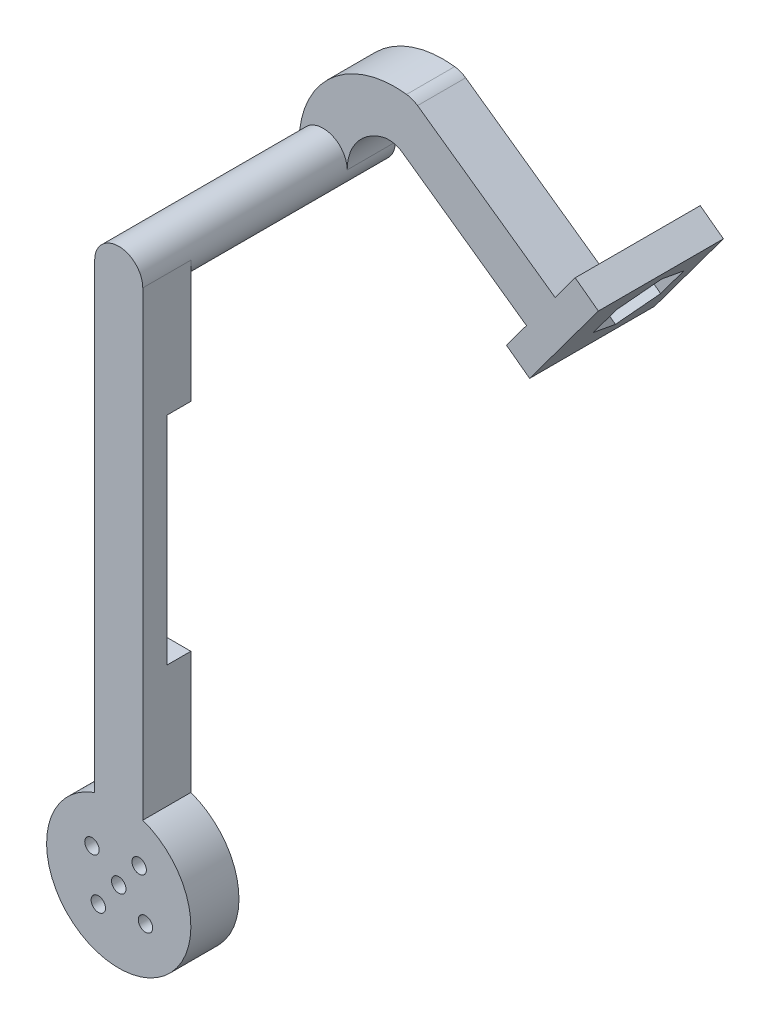
ISO-10303-21;
HEADER;
FILE_DESCRIPTION(('STEP AP214'),'2;1');
FILE_NAME('part.step','',(''),(''),'','','');
FILE_SCHEMA(('AUTOMOTIVE_DESIGN { 1 0 10303 214 1 1 1 1 }'));
ENDSEC;
DATA;
#1=APPLICATION_CONTEXT('core data for automotive mechanical design processes');
#2=APPLICATION_PROTOCOL_DEFINITION('international standard','automotive_design',2000,#1);
#3=PRODUCT_CONTEXT('',#1,'mechanical');
#4=PRODUCT('Part','Part','',(#3));
#5=PRODUCT_RELATED_PRODUCT_CATEGORY('part','',(#4));
#6=PRODUCT_DEFINITION_FORMATION('','',#4);
#7=PRODUCT_DEFINITION_CONTEXT('part definition',#1,'design');
#8=PRODUCT_DEFINITION('design','',#6,#7);
#9=PRODUCT_DEFINITION_SHAPE('','',#8);
#10=(LENGTH_UNIT() NAMED_UNIT(*) SI_UNIT(.MILLI.,.METRE.));
#11=(NAMED_UNIT(*) PLANE_ANGLE_UNIT() SI_UNIT($,.RADIAN.));
#12=(NAMED_UNIT(*) SI_UNIT($,.STERADIAN.) SOLID_ANGLE_UNIT());
#13=UNCERTAINTY_MEASURE_WITH_UNIT(LENGTH_MEASURE(1.E-05),#10,'distance_accuracy_value','');
#14=(GEOMETRIC_REPRESENTATION_CONTEXT(3) GLOBAL_UNCERTAINTY_ASSIGNED_CONTEXT((#13)) GLOBAL_UNIT_ASSIGNED_CONTEXT((#10,
#11,#12)) REPRESENTATION_CONTEXT('',''));
#15=CARTESIAN_POINT('',(0.,0.,0.));
#16=DIRECTION('',(0.,0.,1.));
#17=DIRECTION('',(1.,0.,0.));
#18=AXIS2_PLACEMENT_3D('',#15,#16,#17);
#19=CARTESIAN_POINT('',(-5.,70.,42.5));
#20=DIRECTION('',(0.,0.,1.));
#21=DIRECTION('',(1.,0.,0.));
#22=AXIS2_PLACEMENT_3D('',#19,#20,#21);
#23=PLANE('',#22);
#24=CARTESIAN_POINT('',(-4.99999999999998,-40.,42.5));
#25=DIRECTION('',(0.,0.,-1.));
#26=DIRECTION('',(-1.,0.,0.));
#27=AXIS2_PLACEMENT_3D('',#24,#25,#26);
#28=CIRCLE('',#27,1.5);
#29=CARTESIAN_POINT('',(-6.49999999999998,-40.,42.5));
#30=VERTEX_POINT('',#29);
#31=EDGE_CURVE('E339',#30,#30,#28,.T.);
#32=ORIENTED_EDGE('',*,*,#31,.F.);
#33=EDGE_LOOP('',(#32));
#34=FACE_BOUND('',#33,.T.);
#35=CARTESIAN_POINT('',(-10.5656613127386,-35.7546008253776,42.5));
#36=DIRECTION('',(0.,0.,-1.));
#37=DIRECTION('',(-1.,0.,0.));
#38=AXIS2_PLACEMENT_3D('',#35,#36,#37);
#39=CIRCLE('',#38,1.5);
#40=CARTESIAN_POINT('',(-12.0656613127386,-35.7546008253776,42.5));
#41=VERTEX_POINT('',#40);
#42=EDGE_CURVE('E340',#41,#41,#39,.T.);
#43=ORIENTED_EDGE('',*,*,#42,.F.);
#44=EDGE_LOOP('',(#43));
#45=FACE_BOUND('',#44,.T.);
#46=CARTESIAN_POINT('',(-0.754600825377485,-34.4343386872617,42.5));
#47=DIRECTION('',(0.,0.,-1.));
#48=DIRECTION('',(-1.,0.,0.));
#49=AXIS2_PLACEMENT_3D('',#46,#47,#48);
#50=CIRCLE('',#49,1.50000000000032);
#51=CARTESIAN_POINT('',(-2.2546008253778,-34.4343386872617,42.5));
#52=VERTEX_POINT('',#51);
#53=EDGE_CURVE('E346',#52,#52,#50,.T.);
#54=ORIENTED_EDGE('',*,*,#53,.F.);
#55=EDGE_LOOP('',(#54));
#56=FACE_BOUND('',#55,.T.);
#57=CARTESIAN_POINT('',(0.565661312738365,-44.2453991746228,42.5));
#58=DIRECTION('',(0.,0.,-1.));
#59=DIRECTION('',(-1.,0.,0.));
#60=AXIS2_PLACEMENT_3D('',#57,#58,#59);
#61=CIRCLE('',#60,1.50000000000042);
#62=CARTESIAN_POINT('',(-0.934338687262058,-44.2453991746228,42.5));
#63=VERTEX_POINT('',#62);
#64=EDGE_CURVE('E352',#63,#63,#61,.T.);
#65=ORIENTED_EDGE('',*,*,#64,.F.);
#66=EDGE_LOOP('',(#65));
#67=FACE_BOUND('',#66,.T.);
#68=CARTESIAN_POINT('',(-9.24539917462271,-45.5656613127386,42.5));
#69=DIRECTION('',(0.,0.,-1.));
#70=DIRECTION('',(-1.,0.,0.));
#71=AXIS2_PLACEMENT_3D('',#68,#69,#70);
#72=CIRCLE('',#71,1.50000000000016);
#73=CARTESIAN_POINT('',(-10.7453991746229,-45.5656613127386,42.5));
#74=VERTEX_POINT('',#73);
#75=EDGE_CURVE('E335',#74,#74,#72,.T.);
#76=ORIENTED_EDGE('',*,*,#75,.F.);
#77=EDGE_LOOP('',(#76));
#78=FACE_BOUND('',#77,.T.);
#79=DIRECTION('',(0.,-1.,0.));
#80=VECTOR('',#79,1.);
#81=CARTESIAN_POINT('',(-10.,70.,42.5));
#82=LINE('',#81,#80);
#83=CARTESIAN_POINT('',(-10.,-0.428932188134513,42.5));
#84=VERTEX_POINT('',#83);
#85=CARTESIAN_POINT('',(-9.99999999999999,-25.8578643762691,42.5));
#86=VERTEX_POINT('',#85);
#87=EDGE_CURVE('E363',#84,#86,#82,.T.);
#88=ORIENTED_EDGE('',*,*,#87,.F.);
#89=DIRECTION('',(-1.,0.,0.));
#90=VECTOR('',#89,1.);
#91=CARTESIAN_POINT('',(0.,-0.428932188134511,42.5));
#92=LINE('',#91,#90);
#93=CARTESIAN_POINT('',(0.,-0.428932188134511,42.5));
#94=VERTEX_POINT('',#93);
#95=EDGE_CURVE('E245',#94,#84,#92,.T.);
#96=ORIENTED_EDGE('',*,*,#95,.F.);
#97=DIRECTION('',(0.,1.,0.));
#98=VECTOR('',#97,1.);
#99=CARTESIAN_POINT('',(0.,70.,42.5));
#100=LINE('',#99,#98);
#101=CARTESIAN_POINT('',(0.,-25.857864376269,42.5));
#102=VERTEX_POINT('',#101);
#103=EDGE_CURVE('E236',#102,#94,#100,.T.);
#104=ORIENTED_EDGE('',*,*,#103,.F.);
#105=CARTESIAN_POINT('',(-4.99999999999999,-40.,42.5));
#106=DIRECTION('',(0.,0.,1.));
#107=DIRECTION('',(1.,0.,0.));
#108=AXIS2_PLACEMENT_3D('',#105,#106,#107);
#109=CIRCLE('',#108,15.);
#110=EDGE_CURVE('E379',#86,#102,#109,.T.);
#111=ORIENTED_EDGE('',*,*,#110,.F.);
#112=EDGE_LOOP('',(#88,#96,#104,#111));
#113=FACE_BOUND('',#112,.T.);
#114=ADVANCED_FACE('F35',(#34,#45,#56,#67,#78,#113),#23,.F.);
#115=CARTESIAN_POINT('',(46.8101040062718,66.1183287171004,10.));
#116=DIRECTION('',(0.577822415053882,0.816162518534942,0.));
#117=DIRECTION('',(-0.816162518534942,0.577822415053882,0.));
#118=AXIS2_PLACEMENT_3D('',#115,#116,#117);
#119=PLANE('',#118);
#120=DIRECTION('',(0.816162518534942,-0.577822415053882,0.));
#121=VECTOR('',#120,1.);
#122=CARTESIAN_POINT('',(46.8101040062718,66.1183287171004,10.));
#123=LINE('',#122,#121);
#124=CARTESIAN_POINT('',(14.6370161563222,88.8960609689677,10.));
#125=VERTEX_POINT('',#124);
#126=CARTESIAN_POINT('',(43.2377237554058,68.6474835571825,10.));
#127=VERTEX_POINT('',#126);
#128=EDGE_CURVE('E403',#125,#127,#123,.T.);
#129=ORIENTED_EDGE('',*,*,#128,.T.);
#130=DIRECTION('',(0.,0.,-1.));
#131=VECTOR('',#130,1.);
#132=CARTESIAN_POINT('',(43.2377237554058,68.6474835571825,10.));
#133=LINE('',#132,#131);
#134=CARTESIAN_POINT('',(43.2377237554058,68.6474835571825,0.));
#135=VERTEX_POINT('',#134);
#136=EDGE_CURVE('E311',#127,#135,#133,.T.);
#137=ORIENTED_EDGE('',*,*,#136,.T.);
#138=DIRECTION('',(0.816162518534942,-0.577822415053882,0.));
#139=VECTOR('',#138,1.);
#140=CARTESIAN_POINT('',(46.8101040062718,66.1183287171004,0.));
#141=LINE('',#140,#139);
#142=CARTESIAN_POINT('',(14.6370161563222,88.8960609689677,0.));
#143=VERTEX_POINT('',#142);
#144=EDGE_CURVE('E400',#143,#135,#141,.T.);
#145=ORIENTED_EDGE('',*,*,#144,.F.);
#146=DIRECTION('',(0.,0.,-1.));
#147=VECTOR('',#146,1.);
#148=CARTESIAN_POINT('',(14.6370161563222,88.8960609689677,10.));
#149=LINE('',#148,#147);
#150=EDGE_CURVE('E446',#125,#143,#149,.T.);
#151=ORIENTED_EDGE('',*,*,#150,.F.);
#152=EDGE_LOOP('',(#129,#137,#145,#151));
#153=FACE_BOUND('',#152,.T.);
#154=ADVANCED_FACE('F37',(#153),#119,.T.);
#155=CARTESIAN_POINT('',(41.031879855733,57.956703531751,10.));
#156=DIRECTION('',(0.577822415053882,0.816162518534942,0.));
#157=DIRECTION('',(-0.816162518534942,0.577822415053882,0.));
#158=AXIS2_PLACEMENT_3D('',#155,#156,#157);
#159=PLANE('',#158);
#160=DIRECTION('',(0.,0.,-1.));
#161=VECTOR('',#160,1.);
#162=CARTESIAN_POINT('',(37.282165609397,60.6114063542588,10.));
#163=LINE('',#162,#161);
#164=CARTESIAN_POINT('',(37.282165609397,60.6114063542588,10.));
#165=VERTEX_POINT('',#164);
#166=CARTESIAN_POINT('',(37.282165609397,60.6114063542588,0.));
#167=VERTEX_POINT('',#166);
#168=EDGE_CURVE('E309',#165,#167,#163,.T.);
#169=ORIENTED_EDGE('',*,*,#168,.F.);
#170=DIRECTION('',(0.816162518534942,-0.577822415053882,0.));
#171=VECTOR('',#170,1.);
#172=CARTESIAN_POINT('',(41.031879855733,57.956703531751,10.));
#173=LINE('',#172,#171);
#174=CARTESIAN_POINT('',(11.5366284211116,78.8385953480618,10.));
#175=VERTEX_POINT('',#174);
#176=EDGE_CURVE('E417',#175,#165,#173,.T.);
#177=ORIENTED_EDGE('',*,*,#176,.F.);
#178=DIRECTION('',(0.,0.,-1.));
#179=VECTOR('',#178,1.);
#180=CARTESIAN_POINT('',(11.5366284211116,78.8385953480618,10.));
#181=LINE('',#180,#179);
#182=CARTESIAN_POINT('',(11.5366284211116,78.8385953480618,0.));
#183=VERTEX_POINT('',#182);
#184=EDGE_CURVE('E420',#175,#183,#181,.T.);
#185=ORIENTED_EDGE('',*,*,#184,.T.);
#186=DIRECTION('',(0.816162518534942,-0.577822415053882,0.));
#187=VECTOR('',#186,1.);
#188=CARTESIAN_POINT('',(41.031879855733,57.956703531751,0.));
#189=LINE('',#188,#187);
#190=EDGE_CURVE('E407',#183,#167,#189,.T.);
#191=ORIENTED_EDGE('',*,*,#190,.T.);
#192=EDGE_LOOP('',(#169,#177,#185,#191));
#193=FACE_BOUND('',#192,.T.);
#194=ADVANCED_FACE('F516',(#193),#159,.F.);
#195=CARTESIAN_POINT('',(0.,0.,0.));
#196=DIRECTION('',(0.,0.,1.));
#197=DIRECTION('',(1.,0.,0.));
#198=AXIS2_PLACEMENT_3D('',#195,#196,#197);
#199=PLANE('',#198);
#200=DIRECTION('',(0.595415284473228,0.803418097266713,0.));
#201=VECTOR('',#200,1.);
#202=CARTESIAN_POINT('',(47.4079851150517,74.2745870831456,0.));
#203=LINE('',#202,#201);
#204=CARTESIAN_POINT('',(37.3410147158261,60.6908138507508,0.));
#205=VERTEX_POINT('',#204);
#206=EDGE_CURVE('E43',#167,#205,#203,.T.);
#207=ORIENTED_EDGE('',*,*,#206,.F.);
#208=ORIENTED_EDGE('',*,*,#190,.F.);
#209=CARTESIAN_POINT('',(8.64751634584223,74.7577827553871,0.));
#210=DIRECTION('',(0.,0.,1.));
#211=DIRECTION('',(1.,0.,0.));
#212=AXIS2_PLACEMENT_3D('',#209,#210,#211);
#213=CIRCLE('',#212,5.);
#214=CARTESIAN_POINT('',(7.34925608218081,79.5862939428855,0.));
#215=VERTEX_POINT('',#214);
#216=EDGE_CURVE('E432',#183,#215,#213,.T.);
#217=ORIENTED_EDGE('',*,*,#216,.T.);
#218=CARTESIAN_POINT('',(9.92675958554832,70.,0.));
#219=DIRECTION('',(0.,0.,1.));
#220=DIRECTION('',(1.,0.,0.));
#221=AXIS2_PLACEMENT_3D('',#218,#219,#220);
#222=CIRCLE('',#221,9.92675958554832);
#223=CARTESIAN_POINT('',(0.,70.,0.));
#224=VERTEX_POINT('',#223);
#225=EDGE_CURVE('E429',#224,#215,#222,.F.);
#226=ORIENTED_EDGE('',*,*,#225,.F.);
#227=CARTESIAN_POINT('',(-5.,70.,0.));
#228=DIRECTION('',(0.,0.,-1.));
#229=DIRECTION('',(1.,0.,0.));
#230=AXIS2_PLACEMENT_3D('',#227,#228,#229);
#231=CIRCLE('',#230,5.);
#232=CARTESIAN_POINT('',(-10.,70.,0.));
#233=VERTEX_POINT('',#232);
#234=EDGE_CURVE('E393',#224,#233,#231,.T.);
#235=ORIENTED_EDGE('',*,*,#234,.T.);
#236=CARTESIAN_POINT('',(9.92675958554832,70.,0.));
#237=DIRECTION('',(0.,0.,1.));
#238=DIRECTION('',(1.,0.,0.));
#239=AXIS2_PLACEMENT_3D('',#236,#237,#238);
#240=CIRCLE('',#239,19.9267595855483);
#241=CARTESIAN_POINT('',(12.3579308203016,89.7778955909761,0.));
#242=VERTEX_POINT('',#241);
#243=EDGE_CURVE('E426',#233,#242,#240,.F.);
#244=ORIENTED_EDGE('',*,*,#243,.T.);
#245=CARTESIAN_POINT('',(11.7479040810528,84.815248376293,0.));
#246=DIRECTION('',(0.,0.,1.));
#247=DIRECTION('',(1.,0.,0.));
#248=AXIS2_PLACEMENT_3D('',#245,#246,#247);
#249=CIRCLE('',#248,4.99999999999999);
#250=EDGE_CURVE('E423',#143,#242,#249,.T.);
#251=ORIENTED_EDGE('',*,*,#250,.F.);
#252=ORIENTED_EDGE('',*,*,#144,.T.);
#253=CARTESIAN_POINT('',(43.18498868692,68.5763259811395,0.));
#254=VERTEX_POINT('',#253);
#255=EDGE_CURVE('E327',#254,#135,#203,.T.);
#256=ORIENTED_EDGE('',*,*,#255,.F.);
#257=EDGE_CURVE('E326',#205,#254,#203,.T.);
#258=ORIENTED_EDGE('',*,*,#257,.F.);
#259=EDGE_LOOP('',(#207,#208,#217,#226,#235,#244,#251,#252,#256,#258));
#260=FACE_BOUND('',#259,.T.);
#261=ADVANCED_FACE('F467',(#260),#199,.F.);
#262=CARTESIAN_POINT('',(0.,0.,10.));
#263=DIRECTION('',(0.,0.,1.));
#264=DIRECTION('',(1.,0.,0.));
#265=AXIS2_PLACEMENT_3D('',#262,#263,#264);
#266=PLANE('',#265);
#267=ORIENTED_EDGE('',*,*,#176,.T.);
#268=DIRECTION('',(-0.595415284473228,-0.803418097266713,0.));
#269=VECTOR('',#268,1.);
#270=CARTESIAN_POINT('',(-4.92960569182014,3.65334386332791,10.));
#271=LINE('',#270,#269);
#272=CARTESIAN_POINT('',(33.1180182876942,54.9925527487445,10.));
#273=VERTEX_POINT('',#272);
#274=EDGE_CURVE('E300',#165,#273,#271,.T.);
#275=ORIENTED_EDGE('',*,*,#274,.T.);
#276=DIRECTION('',(0.803418097266713,-0.595415284473228,0.));
#277=VECTOR('',#276,1.);
#278=CARTESIAN_POINT('',(38.0476239795144,51.3392088854166,10.));
#279=LINE('',#278,#277);
#280=CARTESIAN_POINT('',(37.9385268712945,51.4200610419051,10.));
#281=VERTEX_POINT('',#280);
#282=EDGE_CURVE('E303',#273,#281,#279,.T.);
#283=ORIENTED_EDGE('',*,*,#282,.T.);
#284=DIRECTION('',(0.595415284473228,0.803418097266712,0.));
#285=VECTOR('',#284,1.);
#286=CARTESIAN_POINT('',(-0.109097108219928,0.0808521564885917,10.));
#287=LINE('',#286,#285);
#288=CARTESIAN_POINT('',(52.2284936986519,70.7020953763062,10.));
#289=VERTEX_POINT('',#288);
#290=EDGE_CURVE('E306',#281,#289,#287,.T.);
#291=ORIENTED_EDGE('',*,*,#290,.T.);
#292=DIRECTION('',(-0.803418097266713,0.595415284473228,0.));
#293=VECTOR('',#292,1.);
#294=CARTESIAN_POINT('',(52.3375908068718,70.6212432198177,10.));
#295=LINE('',#294,#293);
#296=CARTESIAN_POINT('',(47.4079851150517,74.2745870831456,10.));
#297=VERTEX_POINT('',#296);
#298=EDGE_CURVE('E295',#289,#297,#295,.T.);
#299=ORIENTED_EDGE('',*,*,#298,.T.);
#300=DIRECTION('',(-0.595415284473228,-0.803418097266713,0.));
#301=VECTOR('',#300,1.);
#302=CARTESIAN_POINT('',(-4.92960569182014,3.65334386332791,10.));
#303=LINE('',#302,#301);
#304=EDGE_CURVE('E298',#297,#127,#303,.T.);
#305=ORIENTED_EDGE('',*,*,#304,.T.);
#306=ORIENTED_EDGE('',*,*,#128,.F.);
#307=CARTESIAN_POINT('',(11.7479040810528,84.815248376293,10.));
#308=DIRECTION('',(0.,0.,1.));
#309=DIRECTION('',(1.,0.,0.));
#310=AXIS2_PLACEMENT_3D('',#307,#308,#309);
#311=CIRCLE('',#310,4.99999999999999);
#312=CARTESIAN_POINT('',(12.3579308203016,89.7778955909761,10.));
#313=VERTEX_POINT('',#312);
#314=EDGE_CURVE('E406',#125,#313,#311,.T.);
#315=ORIENTED_EDGE('',*,*,#314,.T.);
#316=CARTESIAN_POINT('',(9.92675958554832,70.,10.));
#317=DIRECTION('',(0.,0.,1.));
#318=DIRECTION('',(1.,0.,0.));
#319=AXIS2_PLACEMENT_3D('',#316,#317,#318);
#320=CIRCLE('',#319,19.9267595855483);
#321=CARTESIAN_POINT('',(-10.,70.,10.));
#322=VERTEX_POINT('',#321);
#323=EDGE_CURVE('E409',#322,#313,#320,.F.);
#324=ORIENTED_EDGE('',*,*,#323,.F.);
#325=CARTESIAN_POINT('',(-5.,70.,10.));
#326=DIRECTION('',(0.,0.,1.));
#327=DIRECTION('',(1.,0.,0.));
#328=AXIS2_PLACEMENT_3D('',#325,#326,#327);
#329=CIRCLE('',#328,5.00000000000001);
#330=CARTESIAN_POINT('',(0.,70.,10.));
#331=VERTEX_POINT('',#330);
#332=EDGE_CURVE('E396',#331,#322,#329,.T.);
#333=ORIENTED_EDGE('',*,*,#332,.F.);
#334=CARTESIAN_POINT('',(9.92675958554832,70.,10.));
#335=DIRECTION('',(0.,0.,1.));
#336=DIRECTION('',(1.,0.,0.));
#337=AXIS2_PLACEMENT_3D('',#334,#335,#336);
#338=CIRCLE('',#337,9.92675958554832);
#339=CARTESIAN_POINT('',(7.34925608218081,79.5862939428855,10.));
#340=VERTEX_POINT('',#339);
#341=EDGE_CURVE('E412',#331,#340,#338,.F.);
#342=ORIENTED_EDGE('',*,*,#341,.T.);
#343=CARTESIAN_POINT('',(8.64751634584223,74.7577827553871,10.));
#344=DIRECTION('',(0.,0.,1.));
#345=DIRECTION('',(1.,0.,0.));
#346=AXIS2_PLACEMENT_3D('',#343,#344,#345);
#347=CIRCLE('',#346,5.);
#348=EDGE_CURVE('E414',#175,#340,#347,.T.);
#349=ORIENTED_EDGE('',*,*,#348,.F.);
#350=EDGE_LOOP('',(#267,#275,#283,#291,#299,#305,#306,#315,#324,#333,#342,#349));
#351=FACE_BOUND('',#350,.T.);
#352=ADVANCED_FACE('F477',(#351),#266,.T.);
#353=CARTESIAN_POINT('',(11.7479040810528,84.815248376293,10.));
#354=DIRECTION('',(0.,0.,-1.));
#355=DIRECTION('',(-1.,0.,0.));
#356=AXIS2_PLACEMENT_3D('',#353,#354,#355);
#357=CYLINDRICAL_SURFACE('',#356,4.99999999999999);
#358=ORIENTED_EDGE('',*,*,#250,.T.);
#359=DIRECTION('',(0.,0.,-1.));
#360=VECTOR('',#359,1.);
#361=CARTESIAN_POINT('',(12.3579308203016,89.7778955909761,10.));
#362=LINE('',#361,#360);
#363=EDGE_CURVE('E445',#313,#242,#362,.T.);
#364=ORIENTED_EDGE('',*,*,#363,.F.);
#365=ORIENTED_EDGE('',*,*,#314,.F.);
#366=ORIENTED_EDGE('',*,*,#150,.T.);
#367=EDGE_LOOP('',(#358,#364,#365,#366));
#368=FACE_BOUND('',#367,.T.);
#369=ADVANCED_FACE('F727',(#368),#357,.T.);
#370=CARTESIAN_POINT('',(9.92675958554832,70.,10.));
#371=DIRECTION('',(0.,0.,-1.));
#372=DIRECTION('',(-1.,0.,0.));
#373=AXIS2_PLACEMENT_3D('',#370,#371,#372);
#374=CYLINDRICAL_SURFACE('',#373,19.9267595855483);
#375=ORIENTED_EDGE('',*,*,#243,.F.);
#376=DIRECTION('',(0.,0.,-1.));
#377=VECTOR('',#376,1.);
#378=CARTESIAN_POINT('',(-10.,70.,10.));
#379=LINE('',#378,#377);
#380=EDGE_CURVE('E443',#322,#233,#379,.T.);
#381=ORIENTED_EDGE('',*,*,#380,.F.);
#382=ORIENTED_EDGE('',*,*,#323,.T.);
#383=ORIENTED_EDGE('',*,*,#363,.T.);
#384=EDGE_LOOP('',(#375,#381,#382,#383));
#385=FACE_BOUND('',#384,.T.);
#386=ADVANCED_FACE('F828',(#385),#374,.T.);
#387=CARTESIAN_POINT('',(9.92675958554832,70.,10.));
#388=DIRECTION('',(0.,0.,-1.));
#389=DIRECTION('',(-1.,0.,0.));
#390=AXIS2_PLACEMENT_3D('',#387,#388,#389);
#391=CYLINDRICAL_SURFACE('',#390,9.92675958554832);
#392=ORIENTED_EDGE('',*,*,#225,.T.);
#393=DIRECTION('',(0.,0.,-1.));
#394=VECTOR('',#393,1.);
#395=CARTESIAN_POINT('',(7.34925608218081,79.5862939428855,10.));
#396=LINE('',#395,#394);
#397=EDGE_CURVE('E438',#340,#215,#396,.T.);
#398=ORIENTED_EDGE('',*,*,#397,.F.);
#399=ORIENTED_EDGE('',*,*,#341,.F.);
#400=DIRECTION('',(0.,0.,-1.));
#401=VECTOR('',#400,1.);
#402=CARTESIAN_POINT('',(0.,70.,10.));
#403=LINE('',#402,#401);
#404=EDGE_CURVE('E440',#331,#224,#403,.T.);
#405=ORIENTED_EDGE('',*,*,#404,.T.);
#406=EDGE_LOOP('',(#392,#398,#399,#405));
#407=FACE_BOUND('',#406,.T.);
#408=ADVANCED_FACE('F823',(#407),#391,.F.);
#409=CARTESIAN_POINT('',(8.64751634584223,74.7577827553871,10.));
#410=DIRECTION('',(0.,0.,-1.));
#411=DIRECTION('',(-1.,0.,0.));
#412=AXIS2_PLACEMENT_3D('',#409,#410,#411);
#413=CYLINDRICAL_SURFACE('',#412,5.);
#414=ORIENTED_EDGE('',*,*,#216,.F.);
#415=ORIENTED_EDGE('',*,*,#184,.F.);
#416=ORIENTED_EDGE('',*,*,#348,.T.);
#417=ORIENTED_EDGE('',*,*,#397,.T.);
#418=EDGE_LOOP('',(#414,#415,#416,#417));
#419=FACE_BOUND('',#418,.T.);
#420=ADVANCED_FACE('F532',(#419),#413,.F.);
#421=CARTESIAN_POINT('',(-5.,70.,42.5));
#422=DIRECTION('',(0.,0.,-1.));
#423=DIRECTION('',(-1.,0.,0.));
#424=AXIS2_PLACEMENT_3D('',#421,#422,#423);
#425=CYLINDRICAL_SURFACE('',#424,5.00000000000001);
#426=CARTESIAN_POINT('',(-5.,70.,42.5));
#427=DIRECTION('',(0.,0.,1.));
#428=DIRECTION('',(1.,0.,0.));
#429=AXIS2_PLACEMENT_3D('',#426,#427,#428);
#430=CIRCLE('',#429,5.00000000000001);
#431=CARTESIAN_POINT('',(-10.,70.,42.5));
#432=VERTEX_POINT('',#431);
#433=CARTESIAN_POINT('',(0.,70.,42.5));
#434=VERTEX_POINT('',#433);
#435=EDGE_CURVE('E397',#432,#434,#430,.T.);
#436=ORIENTED_EDGE('',*,*,#435,.F.);
#437=DIRECTION('',(0.,0.,-1.));
#438=VECTOR('',#437,1.);
#439=CARTESIAN_POINT('',(-10.,70.,52.5));
#440=LINE('',#439,#438);
#441=CARTESIAN_POINT('',(-10.,70.,52.5));
#442=VERTEX_POINT('',#441);
#443=EDGE_CURVE('E390',#442,#432,#440,.T.);
#444=ORIENTED_EDGE('',*,*,#443,.F.);
#445=CARTESIAN_POINT('',(-5.,70.,52.5));
#446=DIRECTION('',(0.,0.,1.));
#447=DIRECTION('',(1.,0.,0.));
#448=AXIS2_PLACEMENT_3D('',#445,#446,#447);
#449=CIRCLE('',#448,5.00000000000001);
#450=CARTESIAN_POINT('',(0.,70.,52.5));
#451=VERTEX_POINT('',#450);
#452=EDGE_CURVE('E366',#451,#442,#449,.T.);
#453=ORIENTED_EDGE('',*,*,#452,.F.);
#454=DIRECTION('',(0.,0.,-1.));
#455=VECTOR('',#454,1.);
#456=CARTESIAN_POINT('',(0.,70.,52.5));
#457=LINE('',#456,#455);
#458=EDGE_CURVE('E375',#451,#434,#457,.T.);
#459=ORIENTED_EDGE('',*,*,#458,.T.);
#460=EDGE_LOOP('',(#436,#444,#453,#459));
#461=FACE_BOUND('',#460,.T.);
#462=ORIENTED_EDGE('',*,*,#332,.T.);
#463=ORIENTED_EDGE('',*,*,#380,.T.);
#464=ORIENTED_EDGE('',*,*,#234,.F.);
#465=ORIENTED_EDGE('',*,*,#404,.F.);
#466=EDGE_LOOP('',(#462,#463,#464,#465));
#467=FACE_BOUND('',#466,.T.);
#468=ADVANCED_FACE('F523',(#461,#467),#425,.T.);
#469=CARTESIAN_POINT('',(0.,44.5710678118655,42.5));
#470=VERTEX_POINT('',#469);
#471=EDGE_CURVE('E381',#470,#434,#100,.T.);
#472=ORIENTED_EDGE('',*,*,#471,.F.);
#473=DIRECTION('',(-1.,0.,0.));
#474=VECTOR('',#473,1.);
#475=CARTESIAN_POINT('',(0.,44.5710678118655,42.5));
#476=LINE('',#475,#474);
#477=CARTESIAN_POINT('',(-10.,44.5710678118655,42.5));
#478=VERTEX_POINT('',#477);
#479=EDGE_CURVE('E247',#470,#478,#476,.T.);
#480=ORIENTED_EDGE('',*,*,#479,.T.);
#481=EDGE_CURVE('E376',#432,#478,#82,.T.);
#482=ORIENTED_EDGE('',*,*,#481,.F.);
#483=ORIENTED_EDGE('',*,*,#435,.T.);
#484=EDGE_LOOP('',(#472,#480,#482,#483));
#485=FACE_BOUND('',#484,.T.);
#486=ADVANCED_FACE('F512',(#485),#23,.F.);
#487=CARTESIAN_POINT('',(-10.,70.,52.5));
#488=DIRECTION('',(1.,0.,0.));
#489=DIRECTION('',(0.,1.,0.));
#490=AXIS2_PLACEMENT_3D('',#487,#488,#489);
#491=PLANE('',#490);
#492=DIRECTION('',(0.,1.,0.));
#493=VECTOR('',#492,1.);
#494=CARTESIAN_POINT('',(-10.,44.5710678118655,47.5));
#495=LINE('',#494,#493);
#496=CARTESIAN_POINT('',(-10.,-0.428932188134523,47.5));
#497=VERTEX_POINT('',#496);
#498=CARTESIAN_POINT('',(-10.,44.5710678118655,47.5));
#499=VERTEX_POINT('',#498);
#500=EDGE_CURVE('E239',#497,#499,#495,.T.);
#501=ORIENTED_EDGE('',*,*,#500,.F.);
#502=DIRECTION('',(0.,0.,1.));
#503=VECTOR('',#502,1.);
#504=CARTESIAN_POINT('',(-10.,-0.428932188134513,42.5));
#505=LINE('',#504,#503);
#506=EDGE_CURVE('E221',#84,#497,#505,.T.);
#507=ORIENTED_EDGE('',*,*,#506,.F.);
#508=ORIENTED_EDGE('',*,*,#87,.T.);
#509=DIRECTION('',(0.,0.,-1.));
#510=VECTOR('',#509,1.);
#511=CARTESIAN_POINT('',(-9.99999999999999,-25.8578643762691,52.5));
#512=LINE('',#511,#510);
#513=CARTESIAN_POINT('',(-9.99999999999999,-25.8578643762691,52.5));
#514=VERTEX_POINT('',#513);
#515=EDGE_CURVE('E387',#514,#86,#512,.T.);
#516=ORIENTED_EDGE('',*,*,#515,.F.);
#517=DIRECTION('',(0.,-1.,0.));
#518=VECTOR('',#517,1.);
#519=CARTESIAN_POINT('',(-10.,70.,52.5));
#520=LINE('',#519,#518);
#521=EDGE_CURVE('E369',#442,#514,#520,.T.);
#522=ORIENTED_EDGE('',*,*,#521,.F.);
#523=ORIENTED_EDGE('',*,*,#443,.T.);
#524=ORIENTED_EDGE('',*,*,#481,.T.);
#525=DIRECTION('',(0.,0.,-1.));
#526=VECTOR('',#525,1.);
#527=CARTESIAN_POINT('',(-10.,44.5710678118655,47.5));
#528=LINE('',#527,#526);
#529=EDGE_CURVE('E237',#499,#478,#528,.T.);
#530=ORIENTED_EDGE('',*,*,#529,.F.);
#531=EDGE_LOOP('',(#501,#507,#508,#516,#522,#523,#524,#530));
#532=FACE_BOUND('',#531,.T.);
#533=ADVANCED_FACE('F522',(#532),#491,.F.);
#534=CARTESIAN_POINT('',(-4.99999999999999,-40.,52.5));
#535=DIRECTION('',(0.,0.,-1.));
#536=DIRECTION('',(-1.,0.,0.));
#537=AXIS2_PLACEMENT_3D('',#534,#535,#536);
#538=CYLINDRICAL_SURFACE('',#537,15.);
#539=ORIENTED_EDGE('',*,*,#110,.T.);
#540=DIRECTION('',(0.,0.,-1.));
#541=VECTOR('',#540,1.);
#542=CARTESIAN_POINT('',(0.,-25.857864376269,52.5));
#543=LINE('',#542,#541);
#544=CARTESIAN_POINT('',(0.,-25.857864376269,52.5));
#545=VERTEX_POINT('',#544);
#546=EDGE_CURVE('E385',#545,#102,#543,.T.);
#547=ORIENTED_EDGE('',*,*,#546,.F.);
#548=CARTESIAN_POINT('',(-4.99999999999999,-40.,52.5));
#549=DIRECTION('',(0.,0.,1.));
#550=DIRECTION('',(1.,0.,0.));
#551=AXIS2_PLACEMENT_3D('',#548,#549,#550);
#552=CIRCLE('',#551,15.);
#553=EDGE_CURVE('E371',#514,#545,#552,.T.);
#554=ORIENTED_EDGE('',*,*,#553,.F.);
#555=ORIENTED_EDGE('',*,*,#515,.T.);
#556=EDGE_LOOP('',(#539,#547,#554,#555));
#557=FACE_BOUND('',#556,.T.);
#558=ADVANCED_FACE('F529',(#557),#538,.T.);
#559=CARTESIAN_POINT('',(0.,70.,52.5));
#560=DIRECTION('',(-1.,0.,0.));
#561=DIRECTION('',(0.,-1.,0.));
#562=AXIS2_PLACEMENT_3D('',#559,#560,#561);
#563=PLANE('',#562);
#564=ORIENTED_EDGE('',*,*,#103,.T.);
#565=DIRECTION('',(0.,0.,1.));
#566=VECTOR('',#565,1.);
#567=CARTESIAN_POINT('',(0.,-0.428932188134511,42.5));
#568=LINE('',#567,#566);
#569=CARTESIAN_POINT('',(0.,-0.428932188134522,47.5));
#570=VERTEX_POINT('',#569);
#571=EDGE_CURVE('E218',#94,#570,#568,.T.);
#572=ORIENTED_EDGE('',*,*,#571,.T.);
#573=DIRECTION('',(0.,1.,0.));
#574=VECTOR('',#573,1.);
#575=CARTESIAN_POINT('',(0.,44.5710678118655,47.5));
#576=LINE('',#575,#574);
#577=CARTESIAN_POINT('',(0.,44.5710678118655,47.5));
#578=VERTEX_POINT('',#577);
#579=EDGE_CURVE('E228',#570,#578,#576,.T.);
#580=ORIENTED_EDGE('',*,*,#579,.T.);
#581=DIRECTION('',(0.,0.,-1.));
#582=VECTOR('',#581,1.);
#583=CARTESIAN_POINT('',(0.,44.5710678118655,47.5));
#584=LINE('',#583,#582);
#585=EDGE_CURVE('E50',#578,#470,#584,.T.);
#586=ORIENTED_EDGE('',*,*,#585,.T.);
#587=ORIENTED_EDGE('',*,*,#471,.T.);
#588=ORIENTED_EDGE('',*,*,#458,.F.);
#589=DIRECTION('',(0.,1.,0.));
#590=VECTOR('',#589,1.);
#591=CARTESIAN_POINT('',(0.,70.,52.5));
#592=LINE('',#591,#590);
#593=EDGE_CURVE('E373',#545,#451,#592,.T.);
#594=ORIENTED_EDGE('',*,*,#593,.F.);
#595=ORIENTED_EDGE('',*,*,#546,.T.);
#596=EDGE_LOOP('',(#564,#572,#580,#586,#587,#588,#594,#595));
#597=FACE_BOUND('',#596,.T.);
#598=ADVANCED_FACE('F233',(#597),#563,.F.);
#599=CARTESIAN_POINT('',(-5.,70.,52.5));
#600=DIRECTION('',(0.,0.,1.));
#601=DIRECTION('',(1.,0.,0.));
#602=AXIS2_PLACEMENT_3D('',#599,#600,#601);
#603=PLANE('',#602);
#604=CARTESIAN_POINT('',(-9.24539917462271,-45.5656613127386,52.5));
#605=DIRECTION('',(0.,0.,-1.));
#606=DIRECTION('',(-1.,0.,0.));
#607=AXIS2_PLACEMENT_3D('',#604,#605,#606);
#608=CIRCLE('',#607,1.50000000000016);
#609=CARTESIAN_POINT('',(-10.7453991746229,-45.5656613127386,52.5));
#610=VERTEX_POINT('',#609);
#611=EDGE_CURVE('E355',#610,#610,#608,.T.);
#612=ORIENTED_EDGE('',*,*,#611,.T.);
#613=EDGE_LOOP('',(#612));
#614=FACE_BOUND('',#613,.T.);
#615=CARTESIAN_POINT('',(0.565661312738365,-44.2453991746228,52.5));
#616=DIRECTION('',(0.,0.,-1.));
#617=DIRECTION('',(-1.,0.,0.));
#618=AXIS2_PLACEMENT_3D('',#615,#616,#617);
#619=CIRCLE('',#618,1.50000000000042);
#620=CARTESIAN_POINT('',(-0.934338687262058,-44.2453991746228,52.5));
#621=VERTEX_POINT('',#620);
#622=EDGE_CURVE('E349',#621,#621,#619,.T.);
#623=ORIENTED_EDGE('',*,*,#622,.T.);
#624=EDGE_LOOP('',(#623));
#625=FACE_BOUND('',#624,.T.);
#626=CARTESIAN_POINT('',(-0.754600825377485,-34.4343386872617,52.5));
#627=DIRECTION('',(0.,0.,-1.));
#628=DIRECTION('',(-1.,0.,0.));
#629=AXIS2_PLACEMENT_3D('',#626,#627,#628);
#630=CIRCLE('',#629,1.50000000000032);
#631=CARTESIAN_POINT('',(-2.2546008253778,-34.4343386872617,52.5));
#632=VERTEX_POINT('',#631);
#633=EDGE_CURVE('E343',#632,#632,#630,.T.);
#634=ORIENTED_EDGE('',*,*,#633,.T.);
#635=EDGE_LOOP('',(#634));
#636=FACE_BOUND('',#635,.T.);
#637=CARTESIAN_POINT('',(-10.5656613127386,-35.7546008253776,52.5));
#638=DIRECTION('',(0.,0.,-1.));
#639=DIRECTION('',(-1.,0.,0.));
#640=AXIS2_PLACEMENT_3D('',#637,#638,#639);
#641=CIRCLE('',#640,1.5);
#642=CARTESIAN_POINT('',(-12.0656613127386,-35.7546008253776,52.5));
#643=VERTEX_POINT('',#642);
#644=EDGE_CURVE('E336',#643,#643,#641,.T.);
#645=ORIENTED_EDGE('',*,*,#644,.T.);
#646=EDGE_LOOP('',(#645));
#647=FACE_BOUND('',#646,.T.);
#648=CARTESIAN_POINT('',(-4.99999999999998,-40.,52.5));
#649=DIRECTION('',(0.,0.,-1.));
#650=DIRECTION('',(-1.,0.,0.));
#651=AXIS2_PLACEMENT_3D('',#648,#649,#650);
#652=CIRCLE('',#651,1.5);
#653=CARTESIAN_POINT('',(-6.49999999999998,-40.,52.5));
#654=VERTEX_POINT('',#653);
#655=EDGE_CURVE('E360',#654,#654,#652,.T.);
#656=ORIENTED_EDGE('',*,*,#655,.T.);
#657=EDGE_LOOP('',(#656));
#658=FACE_BOUND('',#657,.T.);
#659=ORIENTED_EDGE('',*,*,#452,.T.);
#660=ORIENTED_EDGE('',*,*,#521,.T.);
#661=ORIENTED_EDGE('',*,*,#553,.T.);
#662=ORIENTED_EDGE('',*,*,#593,.T.);
#663=EDGE_LOOP('',(#659,#660,#661,#662));
#664=FACE_BOUND('',#663,.T.);
#665=ADVANCED_FACE('F543',(#614,#625,#636,#647,#658,#664),#603,.T.);
#666=CARTESIAN_POINT('',(-4.99999999999998,-40.,52.5));
#667=DIRECTION('',(0.,0.,-1.));
#668=DIRECTION('',(-1.,0.,0.));
#669=AXIS2_PLACEMENT_3D('',#666,#667,#668);
#670=CYLINDRICAL_SURFACE('',#669,1.5);
#671=ORIENTED_EDGE('',*,*,#655,.F.);
#672=EDGE_LOOP('',(#671));
#673=FACE_BOUND('',#672,.T.);
#674=ORIENTED_EDGE('',*,*,#31,.T.);
#675=EDGE_LOOP('',(#674));
#676=FACE_BOUND('',#675,.T.);
#677=ADVANCED_FACE('F793',(#673,#676),#670,.F.);
#678=CARTESIAN_POINT('',(-10.5656613127386,-35.7546008253776,52.5));
#679=DIRECTION('',(0.,0.,-1.));
#680=DIRECTION('',(-1.,0.,0.));
#681=AXIS2_PLACEMENT_3D('',#678,#679,#680);
#682=CYLINDRICAL_SURFACE('',#681,1.5);
#683=ORIENTED_EDGE('',*,*,#644,.F.);
#684=EDGE_LOOP('',(#683));
#685=FACE_BOUND('',#684,.T.);
#686=ORIENTED_EDGE('',*,*,#42,.T.);
#687=EDGE_LOOP('',(#686));
#688=FACE_BOUND('',#687,.T.);
#689=ADVANCED_FACE('F784',(#685,#688),#682,.F.);
#690=CARTESIAN_POINT('',(-0.754600825377485,-34.4343386872617,52.5));
#691=DIRECTION('',(0.,0.,-1.));
#692=DIRECTION('',(-1.,0.,0.));
#693=AXIS2_PLACEMENT_3D('',#690,#691,#692);
#694=CYLINDRICAL_SURFACE('',#693,1.50000000000032);
#695=ORIENTED_EDGE('',*,*,#633,.F.);
#696=EDGE_LOOP('',(#695));
#697=FACE_BOUND('',#696,.T.);
#698=ORIENTED_EDGE('',*,*,#53,.T.);
#699=EDGE_LOOP('',(#698));
#700=FACE_BOUND('',#699,.T.);
#701=ADVANCED_FACE('F775',(#697,#700),#694,.F.);
#702=CARTESIAN_POINT('',(0.565661312738365,-44.2453991746228,52.5));
#703=DIRECTION('',(0.,0.,-1.));
#704=DIRECTION('',(-1.,0.,0.));
#705=AXIS2_PLACEMENT_3D('',#702,#703,#704);
#706=CYLINDRICAL_SURFACE('',#705,1.50000000000042);
#707=ORIENTED_EDGE('',*,*,#622,.F.);
#708=EDGE_LOOP('',(#707));
#709=FACE_BOUND('',#708,.T.);
#710=ORIENTED_EDGE('',*,*,#64,.T.);
#711=EDGE_LOOP('',(#710));
#712=FACE_BOUND('',#711,.T.);
#713=ADVANCED_FACE('F504',(#709,#712),#706,.F.);
#714=CARTESIAN_POINT('',(-9.24539917462271,-45.5656613127386,52.5));
#715=DIRECTION('',(0.,0.,-1.));
#716=DIRECTION('',(-1.,0.,0.));
#717=AXIS2_PLACEMENT_3D('',#714,#715,#716);
#718=CYLINDRICAL_SURFACE('',#717,1.50000000000016);
#719=ORIENTED_EDGE('',*,*,#611,.F.);
#720=EDGE_LOOP('',(#719));
#721=FACE_BOUND('',#720,.T.);
#722=ORIENTED_EDGE('',*,*,#75,.T.);
#723=EDGE_LOOP('',(#722));
#724=FACE_BOUND('',#723,.T.);
#725=ADVANCED_FACE('F496',(#721,#724),#718,.F.);
#726=CARTESIAN_POINT('',(52.2284936986519,70.7020953763062,-16.));
#727=DIRECTION('',(-0.803418097266712,0.595415284473228,0.));
#728=DIRECTION('',(-0.595415284473228,-0.803418097266713,0.));
#729=AXIS2_PLACEMENT_3D('',#726,#727,#728);
#730=PLANE('',#729);
#731=DIRECTION('',(0.595415284473229,0.803418097266712,0.));
#732=VECTOR('',#731,1.);
#733=CARTESIAN_POINT('',(42.6771680615817,57.8141026260045,-12.5000000000001));
#734=LINE('',#733,#732);
#735=CARTESIAN_POINT('',(42.6771680615816,57.8141026260045,-12.5000000000001));
#736=VERTEX_POINT('',#735);
#737=CARTESIAN_POINT('',(47.489852508365,64.308053792207,-12.5000000000001));
#738=VERTEX_POINT('',#737);
#739=EDGE_CURVE('E268',#736,#738,#734,.T.);
#740=ORIENTED_EDGE('',*,*,#739,.F.);
#741=DIRECTION('',(0.297707642236617,0.401709048633361,-0.866025403784435));
#742=VECTOR('',#741,1.);
#743=CARTESIAN_POINT('',(40.27082583819,54.5671270429032,-5.50000000000025));
#744=LINE('',#743,#742);
#745=CARTESIAN_POINT('',(40.27082583819,54.5671270429032,-5.50000000000025));
#746=VERTEX_POINT('',#745);
#747=EDGE_CURVE('E58',#746,#736,#744,.T.);
#748=ORIENTED_EDGE('',*,*,#747,.F.);
#749=DIRECTION('',(-0.297707642236609,-0.401709048633348,-0.866025403784444));
#750=VECTOR('',#749,1.);
#751=CARTESIAN_POINT('',(42.6771680615816,57.8141026260045,1.49999999999981));
#752=LINE('',#751,#750);
#753=CARTESIAN_POINT('',(42.6771680615816,57.8141026260045,1.49999999999981));
#754=VERTEX_POINT('',#753);
#755=EDGE_CURVE('E280',#754,#746,#752,.T.);
#756=ORIENTED_EDGE('',*,*,#755,.F.);
#757=DIRECTION('',(-0.595415284473229,-0.803418097266712,0.));
#758=VECTOR('',#757,1.);
#759=CARTESIAN_POINT('',(47.4898525083649,64.308053792207,1.49999999999988));
#760=LINE('',#759,#758);
#761=CARTESIAN_POINT('',(47.4898525083649,64.308053792207,1.49999999999988));
#762=VERTEX_POINT('',#761);
#763=EDGE_CURVE('E277',#762,#754,#760,.T.);
#764=ORIENTED_EDGE('',*,*,#763,.F.);
#765=DIRECTION('',(-0.297707642236617,-0.401709048633361,0.866025403784436));
#766=VECTOR('',#765,1.);
#767=CARTESIAN_POINT('',(49.8961947317566,67.5550293753083,-5.50000000000011));
#768=LINE('',#767,#766);
#769=CARTESIAN_POINT('',(49.8961947317566,67.5550293753083,-5.50000000000011));
#770=VERTEX_POINT('',#769);
#771=EDGE_CURVE('E274',#770,#762,#768,.T.);
#772=ORIENTED_EDGE('',*,*,#771,.F.);
#773=DIRECTION('',(0.297707642236612,0.401709048633354,0.86602540378444));
#774=VECTOR('',#773,1.);
#775=CARTESIAN_POINT('',(47.489852508365,64.308053792207,-12.5000000000001));
#776=LINE('',#775,#774);
#777=EDGE_CURVE('E271',#738,#770,#776,.T.);
#778=ORIENTED_EDGE('',*,*,#777,.F.);
#779=EDGE_LOOP('',(#740,#748,#756,#764,#772,#778));
#780=FACE_BOUND('',#779,.T.);
#781=DIRECTION('',(0.,0.,1.));
#782=VECTOR('',#781,1.);
#783=CARTESIAN_POINT('',(52.2284936986519,70.7020953763062,-16.));
#784=LINE('',#783,#782);
#785=CARTESIAN_POINT('',(52.2284936986519,70.7020953763062,-16.));
#786=VERTEX_POINT('',#785);
#787=EDGE_CURVE('E323',#786,#289,#784,.T.);
#788=ORIENTED_EDGE('',*,*,#787,.T.);
#789=ORIENTED_EDGE('',*,*,#290,.F.);
#790=DIRECTION('',(0.,0.,1.));
#791=VECTOR('',#790,1.);
#792=CARTESIAN_POINT('',(37.9385268712945,51.4200610419051,-16.));
#793=LINE('',#792,#791);
#794=CARTESIAN_POINT('',(37.9385268712945,51.4200610419051,-16.));
#795=VERTEX_POINT('',#794);
#796=EDGE_CURVE('E333',#795,#281,#793,.T.);
#797=ORIENTED_EDGE('',*,*,#796,.F.);
#798=DIRECTION('',(-0.595415284473228,-0.803418097266712,0.));
#799=VECTOR('',#798,1.);
#800=CARTESIAN_POINT('',(52.2284936986519,70.7020953763062,-16.));
#801=LINE('',#800,#799);
#802=EDGE_CURVE('E314',#786,#795,#801,.T.);
#803=ORIENTED_EDGE('',*,*,#802,.F.);
#804=EDGE_LOOP('',(#788,#789,#797,#803));
#805=FACE_BOUND('',#804,.T.);
#806=ADVANCED_FACE('F494',(#780,#805),#730,.F.);
#807=CARTESIAN_POINT('',(37.9385268712945,51.4200610419051,-16.));
#808=DIRECTION('',(0.595415284473228,0.803418097266713,0.));
#809=DIRECTION('',(-0.803418097266713,0.595415284473228,0.));
#810=AXIS2_PLACEMENT_3D('',#807,#808,#809);
#811=PLANE('',#810);
#812=ORIENTED_EDGE('',*,*,#796,.T.);
#813=ORIENTED_EDGE('',*,*,#282,.F.);
#814=DIRECTION('',(0.,0.,1.));
#815=VECTOR('',#814,1.);
#816=CARTESIAN_POINT('',(33.1180182876942,54.9925527487445,-16.));
#817=LINE('',#816,#815);
#818=CARTESIAN_POINT('',(33.1180182876942,54.9925527487445,-16.));
#819=VERTEX_POINT('',#818);
#820=EDGE_CURVE('E331',#819,#273,#817,.T.);
#821=ORIENTED_EDGE('',*,*,#820,.F.);
#822=DIRECTION('',(-0.803418097266713,0.595415284473228,0.));
#823=VECTOR('',#822,1.);
#824=CARTESIAN_POINT('',(37.9385268712945,51.4200610419051,-16.));
#825=LINE('',#824,#823);
#826=EDGE_CURVE('E317',#795,#819,#825,.T.);
#827=ORIENTED_EDGE('',*,*,#826,.F.);
#828=EDGE_LOOP('',(#812,#813,#821,#827));
#829=FACE_BOUND('',#828,.T.);
#830=ADVANCED_FACE('F492',(#829),#811,.F.);
#831=CARTESIAN_POINT('',(47.4079851150517,74.2745870831456,-16.));
#832=DIRECTION('',(0.803418097266713,-0.595415284473228,0.));
#833=DIRECTION('',(0.595415284473228,0.803418097266713,0.));
#834=AXIS2_PLACEMENT_3D('',#831,#832,#833);
#835=PLANE('',#834);
#836=ORIENTED_EDGE('',*,*,#206,.T.);
#837=DIRECTION('',(0.297707642236608,0.401709048633348,0.866025403784444));
#838=VECTOR('',#837,1.);
#839=CARTESIAN_POINT('',(37.8566594779814,61.3865943328438,1.49999999999981));
#840=LINE('',#839,#838);
#841=CARTESIAN_POINT('',(35.4503172545897,58.1396187497426,-5.50000000000025));
#842=VERTEX_POINT('',#841);
#843=EDGE_CURVE('E261',#842,#205,#840,.T.);
#844=ORIENTED_EDGE('',*,*,#843,.F.);
#845=DIRECTION('',(-0.297707642236617,-0.401709048633361,0.866025403784436));
#846=VECTOR('',#845,1.);
#847=CARTESIAN_POINT('',(35.4503172545897,58.1396187497426,-5.50000000000026));
#848=LINE('',#847,#846);
#849=CARTESIAN_POINT('',(37.8566594779814,61.3865943328439,-12.5000000000001));
#850=VERTEX_POINT('',#849);
#851=EDGE_CURVE('E264',#850,#842,#848,.T.);
#852=ORIENTED_EDGE('',*,*,#851,.F.);
#853=DIRECTION('',(-0.595415284473228,-0.803418097266713,0.));
#854=VECTOR('',#853,1.);
#855=CARTESIAN_POINT('',(37.8566594779814,61.3865943328439,-12.5000000000001));
#856=LINE('',#855,#854);
#857=CARTESIAN_POINT('',(42.6693439247647,67.8805454990464,-12.5000000000001));
#858=VERTEX_POINT('',#857);
#859=EDGE_CURVE('E266',#858,#850,#856,.T.);
#860=ORIENTED_EDGE('',*,*,#859,.F.);
#861=DIRECTION('',(-0.297707642236612,-0.401709048633354,-0.86602540378444));
#862=VECTOR('',#861,1.);
#863=CARTESIAN_POINT('',(42.6693439247647,67.8805454990464,-12.5000000000001));
#864=LINE('',#863,#862);
#865=CARTESIAN_POINT('',(45.0756861481563,71.1275210821477,-5.50000000000011));
#866=VERTEX_POINT('',#865);
#867=EDGE_CURVE('E251',#866,#858,#864,.T.);
#868=ORIENTED_EDGE('',*,*,#867,.F.);
#869=DIRECTION('',(-0.297707642236617,-0.401709048633361,0.866025403784435));
#870=VECTOR('',#869,1.);
#871=CARTESIAN_POINT('',(48.3658958911958,75.5671351133861,-15.0711524227066));
#872=LINE('',#871,#870);
#873=EDGE_CURVE('E11',#866,#254,#872,.T.);
#874=ORIENTED_EDGE('',*,*,#873,.T.);
#875=ORIENTED_EDGE('',*,*,#255,.T.);
#876=ORIENTED_EDGE('',*,*,#136,.F.);
#877=ORIENTED_EDGE('',*,*,#304,.F.);
#878=DIRECTION('',(0.,0.,1.));
#879=VECTOR('',#878,1.);
#880=CARTESIAN_POINT('',(47.4079851150517,74.2745870831456,-16.));
#881=LINE('',#880,#879);
#882=CARTESIAN_POINT('',(47.4079851150517,74.2745870831456,-16.));
#883=VERTEX_POINT('',#882);
#884=EDGE_CURVE('E329',#883,#297,#881,.T.);
#885=ORIENTED_EDGE('',*,*,#884,.F.);
#886=DIRECTION('',(0.595415284473228,0.803418097266713,0.));
#887=VECTOR('',#886,1.);
#888=CARTESIAN_POINT('',(47.4079851150517,74.2745870831456,-16.));
#889=LINE('',#888,#887);
#890=EDGE_CURVE('E319',#819,#883,#889,.T.);
#891=ORIENTED_EDGE('',*,*,#890,.F.);
#892=ORIENTED_EDGE('',*,*,#820,.T.);
#893=ORIENTED_EDGE('',*,*,#274,.F.);
#894=ORIENTED_EDGE('',*,*,#168,.T.);
#895=EDGE_LOOP('',(#836,#844,#852,#860,#868,#874,#875,#876,#877,#885,#891,#892,#893,#894));
#896=FACE_BOUND('',#895,.T.);
#897=ADVANCED_FACE('F465',(#896),#835,.F.);
#898=CARTESIAN_POINT('',(52.2284936986519,70.7020953763062,-16.));
#899=DIRECTION('',(-0.595415284473228,-0.803418097266713,0.));
#900=DIRECTION('',(0.803418097266713,-0.595415284473228,0.));
#901=AXIS2_PLACEMENT_3D('',#898,#899,#900);
#902=PLANE('',#901);
#903=ORIENTED_EDGE('',*,*,#884,.T.);
#904=ORIENTED_EDGE('',*,*,#298,.F.);
#905=ORIENTED_EDGE('',*,*,#787,.F.);
#906=DIRECTION('',(0.803418097266713,-0.595415284473228,0.));
#907=VECTOR('',#906,1.);
#908=CARTESIAN_POINT('',(52.2284936986519,70.7020953763062,-16.));
#909=LINE('',#908,#907);
#910=EDGE_CURVE('E321',#883,#786,#909,.T.);
#911=ORIENTED_EDGE('',*,*,#910,.F.);
#912=EDGE_LOOP('',(#903,#904,#905,#911));
#913=FACE_BOUND('',#912,.T.);
#914=ADVANCED_FACE('F481',(#913),#902,.F.);
#915=CARTESIAN_POINT('',(0.,0.,-16.));
#916=DIRECTION('',(0.,0.,-1.));
#917=DIRECTION('',(-1.,0.,0.));
#918=AXIS2_PLACEMENT_3D('',#915,#916,#917);
#919=PLANE('',#918);
#920=ORIENTED_EDGE('',*,*,#802,.T.);
#921=ORIENTED_EDGE('',*,*,#826,.T.);
#922=ORIENTED_EDGE('',*,*,#890,.T.);
#923=ORIENTED_EDGE('',*,*,#910,.T.);
#924=EDGE_LOOP('',(#920,#921,#922,#923));
#925=FACE_BOUND('',#924,.T.);
#926=ADVANCED_FACE('F484',(#925),#919,.T.);
#927=CARTESIAN_POINT('',(47.4079851150517,74.2745870831456,-16.));
#928=DIRECTION('',(0.803418097266713,-0.595415284473228,0.));
#929=DIRECTION('',(0.595415284473228,0.803418097266713,0.));
#930=AXIS2_PLACEMENT_3D('',#927,#928,#929);
#931=PLANE('',#930);
#932=ORIENTED_EDGE('',*,*,#257,.T.);
#933=DIRECTION('',(0.297707642236617,0.401709048633361,-0.866025403784435));
#934=VECTOR('',#933,1.);
#935=CARTESIAN_POINT('',(45.0756861481563,71.1275210821477,-5.50000000000012));
#936=LINE('',#935,#934);
#937=CARTESIAN_POINT('',(42.6693439247646,67.8805454990464,1.49999999999988));
#938=VERTEX_POINT('',#937);
#939=EDGE_CURVE('E254',#938,#254,#936,.T.);
#940=ORIENTED_EDGE('',*,*,#939,.F.);
#941=DIRECTION('',(0.595415284473228,0.803418097266713,0.));
#942=VECTOR('',#941,1.);
#943=CARTESIAN_POINT('',(42.6693439247647,67.8805454990464,1.49999999999988));
#944=LINE('',#943,#942);
#945=CARTESIAN_POINT('',(37.8566594779813,61.3865943328438,1.49999999999981));
#946=VERTEX_POINT('',#945);
#947=EDGE_CURVE('E258',#946,#938,#944,.T.);
#948=ORIENTED_EDGE('',*,*,#947,.F.);
#949=EDGE_CURVE('E260',#205,#946,#840,.T.);
#950=ORIENTED_EDGE('',*,*,#949,.F.);
#951=EDGE_LOOP('',(#932,#940,#948,#950));
#952=FACE_BOUND('',#951,.T.);
#953=ADVANCED_FACE('F456',(#952),#931,.T.);
#954=CARTESIAN_POINT('',(18.2689374426199,70.8727849345597,-5.50000000000025));
#955=DIRECTION('',(-0.515644762155352,-0.695780482093127,-0.500000000000005));
#956=DIRECTION('',(0.803418097266712,-0.595415284473229,0.));
#957=AXIS2_PLACEMENT_3D('',#954,#955,#956);
#958=PLANE('',#957);
#959=ORIENTED_EDGE('',*,*,#851,.T.);
#960=DIRECTION('',(0.803418097266712,-0.595415284473229,0.));
#961=VECTOR('',#960,1.);
#962=CARTESIAN_POINT('',(18.2689374426199,70.8727849345597,-5.50000000000025));
#963=LINE('',#962,#961);
#964=EDGE_CURVE('E255',#842,#746,#963,.T.);
#965=ORIENTED_EDGE('',*,*,#964,.T.);
#966=ORIENTED_EDGE('',*,*,#747,.T.);
#967=DIRECTION('',(0.803418097266712,-0.595415284473229,0.));
#968=VECTOR('',#967,1.);
#969=CARTESIAN_POINT('',(20.6752796660116,74.119760517661,-12.5000000000001));
#970=LINE('',#969,#968);
#971=EDGE_CURVE('E283',#850,#736,#970,.T.);
#972=ORIENTED_EDGE('',*,*,#971,.F.);
#973=EDGE_LOOP('',(#959,#965,#966,#972));
#974=FACE_BOUND('',#973,.T.);
#975=ADVANCED_FACE('F565',(#974),#958,.F.);
#976=CARTESIAN_POINT('',(20.6752796660115,74.1197605176609,1.49999999999981));
#977=DIRECTION('',(-0.515644762155358,-0.695780482093135,0.49999999999999));
#978=DIRECTION('',(0.803418097266712,-0.595415284473229,0.));
#979=AXIS2_PLACEMENT_3D('',#976,#977,#978);
#980=PLANE('',#979);
#981=ORIENTED_EDGE('',*,*,#843,.T.);
#982=ORIENTED_EDGE('',*,*,#949,.T.);
#983=DIRECTION('',(0.803418097266712,-0.595415284473229,0.));
#984=VECTOR('',#983,1.);
#985=CARTESIAN_POINT('',(20.6752796660115,74.1197605176609,1.49999999999981));
#986=LINE('',#985,#984);
#987=EDGE_CURVE('E285',#946,#754,#986,.T.);
#988=ORIENTED_EDGE('',*,*,#987,.T.);
#989=ORIENTED_EDGE('',*,*,#755,.T.);
#990=ORIENTED_EDGE('',*,*,#964,.F.);
#991=EDGE_LOOP('',(#981,#982,#988,#989,#990));
#992=FACE_BOUND('',#991,.T.);
#993=ADVANCED_FACE('F566',(#992),#980,.F.);
#994=CARTESIAN_POINT('',(25.4879641127948,80.6137116838635,1.49999999999988));
#995=DIRECTION('',(0.,0.,1.));
#996=DIRECTION('',(0.,-1.,0.));
#997=AXIS2_PLACEMENT_3D('',#994,#995,#996);
#998=PLANE('',#997);
#999=ORIENTED_EDGE('',*,*,#947,.T.);
#1000=DIRECTION('',(0.803418097266712,-0.595415284473229,0.));
#1001=VECTOR('',#1000,1.);
#1002=CARTESIAN_POINT('',(25.4879641127948,80.6137116838635,1.49999999999988));
#1003=LINE('',#1002,#1001);
#1004=EDGE_CURVE('E287',#938,#762,#1003,.T.);
#1005=ORIENTED_EDGE('',*,*,#1004,.T.);
#1006=ORIENTED_EDGE('',*,*,#763,.T.);
#1007=ORIENTED_EDGE('',*,*,#987,.F.);
#1008=EDGE_LOOP('',(#999,#1005,#1006,#1007));
#1009=FACE_BOUND('',#1008,.T.);
#1010=ADVANCED_FACE('F569',(#1009),#998,.F.);
#1011=CARTESIAN_POINT('',(27.8943063361865,83.8606872669648,-5.50000000000011));
#1012=DIRECTION('',(0.515644762155352,0.695780482093127,0.500000000000005));
#1013=DIRECTION('',(-0.803418097266712,0.595415284473229,0.));
#1014=AXIS2_PLACEMENT_3D('',#1011,#1012,#1013);
#1015=PLANE('',#1014);
#1016=ORIENTED_EDGE('',*,*,#939,.T.);
#1017=ORIENTED_EDGE('',*,*,#873,.F.);
#1018=DIRECTION('',(0.803418097266712,-0.595415284473229,0.));
#1019=VECTOR('',#1018,1.);
#1020=CARTESIAN_POINT('',(27.8943063361865,83.8606872669648,-5.50000000000011));
#1021=LINE('',#1020,#1019);
#1022=EDGE_CURVE('E289',#866,#770,#1021,.T.);
#1023=ORIENTED_EDGE('',*,*,#1022,.T.);
#1024=ORIENTED_EDGE('',*,*,#771,.T.);
#1025=ORIENTED_EDGE('',*,*,#1004,.F.);
#1026=EDGE_LOOP('',(#1016,#1017,#1023,#1024,#1025));
#1027=FACE_BOUND('',#1026,.T.);
#1028=ADVANCED_FACE('F462',(#1027),#1015,.F.);
#1029=CARTESIAN_POINT('',(25.4879641127949,80.6137116838635,-12.5000000000001));
#1030=DIRECTION('',(0.515644762155355,0.695780482093131,-0.499999999999997));
#1031=DIRECTION('',(-0.803418097266712,0.595415284473229,0.));
#1032=AXIS2_PLACEMENT_3D('',#1029,#1030,#1031);
#1033=PLANE('',#1032);
#1034=ORIENTED_EDGE('',*,*,#867,.T.);
#1035=DIRECTION('',(0.803418097266712,-0.595415284473229,0.));
#1036=VECTOR('',#1035,1.);
#1037=CARTESIAN_POINT('',(25.4879641127949,80.6137116838635,-12.5000000000001));
#1038=LINE('',#1037,#1036);
#1039=EDGE_CURVE('E291',#858,#738,#1038,.T.);
#1040=ORIENTED_EDGE('',*,*,#1039,.T.);
#1041=ORIENTED_EDGE('',*,*,#777,.T.);
#1042=ORIENTED_EDGE('',*,*,#1022,.F.);
#1043=EDGE_LOOP('',(#1034,#1040,#1041,#1042));
#1044=FACE_BOUND('',#1043,.T.);
#1045=ADVANCED_FACE('F576',(#1044),#1033,.F.);
#1046=CARTESIAN_POINT('',(20.6752796660116,74.119760517661,-12.5000000000001));
#1047=DIRECTION('',(0.,0.,-1.));
#1048=DIRECTION('',(0.,1.,0.));
#1049=AXIS2_PLACEMENT_3D('',#1046,#1047,#1048);
#1050=PLANE('',#1049);
#1051=ORIENTED_EDGE('',*,*,#859,.T.);
#1052=ORIENTED_EDGE('',*,*,#971,.T.);
#1053=ORIENTED_EDGE('',*,*,#739,.T.);
#1054=ORIENTED_EDGE('',*,*,#1039,.F.);
#1055=EDGE_LOOP('',(#1051,#1052,#1053,#1054));
#1056=FACE_BOUND('',#1055,.T.);
#1057=ADVANCED_FACE('F560',(#1056),#1050,.F.);
#1058=CARTESIAN_POINT('',(0.,-0.428932188134511,42.5));
#1059=DIRECTION('',(0.,-1.,0.));
#1060=DIRECTION('',(0.,0.,-1.));
#1061=AXIS2_PLACEMENT_3D('',#1058,#1059,#1060);
#1062=PLANE('',#1061);
#1063=ORIENTED_EDGE('',*,*,#506,.T.);
#1064=DIRECTION('',(-1.,0.,0.));
#1065=VECTOR('',#1064,1.);
#1066=CARTESIAN_POINT('',(0.,-0.428932188134522,47.5));
#1067=LINE('',#1066,#1065);
#1068=EDGE_CURVE('E214',#570,#497,#1067,.T.);
#1069=ORIENTED_EDGE('',*,*,#1068,.F.);
#1070=ORIENTED_EDGE('',*,*,#571,.F.);
#1071=ORIENTED_EDGE('',*,*,#95,.T.);
#1072=EDGE_LOOP('',(#1063,#1069,#1070,#1071));
#1073=FACE_BOUND('',#1072,.T.);
#1074=ADVANCED_FACE('F216',(#1073),#1062,.F.);
#1075=CARTESIAN_POINT('',(0.,44.5710678118655,47.5));
#1076=DIRECTION('',(0.,1.,0.));
#1077=DIRECTION('',(0.,0.,1.));
#1078=AXIS2_PLACEMENT_3D('',#1075,#1076,#1077);
#1079=PLANE('',#1078);
#1080=ORIENTED_EDGE('',*,*,#529,.T.);
#1081=ORIENTED_EDGE('',*,*,#479,.F.);
#1082=ORIENTED_EDGE('',*,*,#585,.F.);
#1083=DIRECTION('',(-1.,0.,0.));
#1084=VECTOR('',#1083,1.);
#1085=CARTESIAN_POINT('',(0.,44.5710678118655,47.5));
#1086=LINE('',#1085,#1084);
#1087=EDGE_CURVE('E225',#578,#499,#1086,.T.);
#1088=ORIENTED_EDGE('',*,*,#1087,.T.);
#1089=EDGE_LOOP('',(#1080,#1081,#1082,#1088));
#1090=FACE_BOUND('',#1089,.T.);
#1091=ADVANCED_FACE('F552',(#1090),#1079,.F.);
#1092=CARTESIAN_POINT('',(0.,44.5710678118655,47.5));
#1093=DIRECTION('',(0.,0.,1.));
#1094=DIRECTION('',(1.,0.,0.));
#1095=AXIS2_PLACEMENT_3D('',#1092,#1093,#1094);
#1096=PLANE('',#1095);
#1097=ORIENTED_EDGE('',*,*,#500,.T.);
#1098=ORIENTED_EDGE('',*,*,#1087,.F.);
#1099=ORIENTED_EDGE('',*,*,#579,.F.);
#1100=ORIENTED_EDGE('',*,*,#1068,.T.);
#1101=EDGE_LOOP('',(#1097,#1098,#1099,#1100));
#1102=FACE_BOUND('',#1101,.T.);
#1103=ADVANCED_FACE('F229',(#1102),#1096,.F.);
#1104=CLOSED_SHELL('',(#114,#154,#194,#261,#352,#369,#386,#408,#420,#468,#486,#533,#558,#598,
#665,#677,#689,#701,#713,#725,#806,#830,#897,#914,#926,#953,#975,#993,#1010,#1028,#1045,#1057,
#1074,#1091,#1103));
#1105=MANIFOLD_SOLID_BREP('B2',#1104);
#1106=ADVANCED_BREP_SHAPE_REPRESENTATION('',(#18,#1105),#14);
#1107=SHAPE_DEFINITION_REPRESENTATION(#9,#1106);
ENDSEC;
END-ISO-10303-21;
